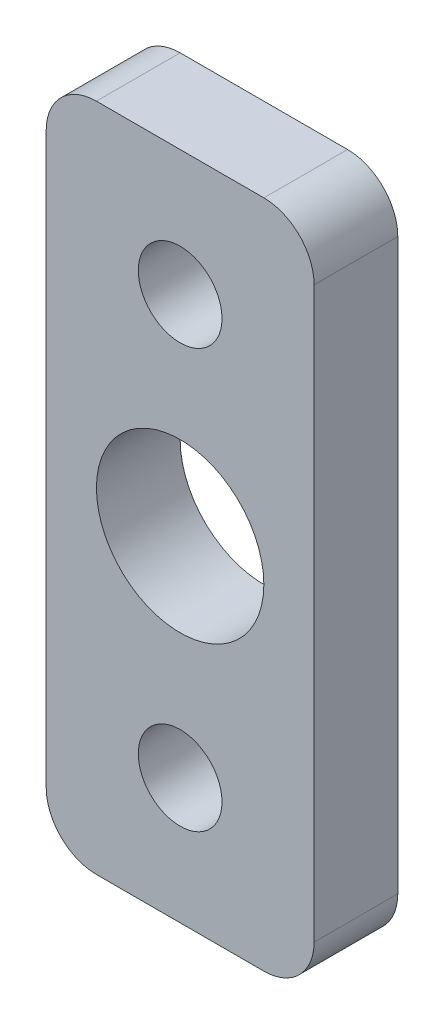
ISO-10303-21;
HEADER;
FILE_DESCRIPTION(('STEP AP214'),'2;1');
FILE_NAME('part.step','',(''),(''),'','','');
FILE_SCHEMA(('AUTOMOTIVE_DESIGN { 1 0 10303 214 1 1 1 1 }'));
ENDSEC;
DATA;
#1=APPLICATION_CONTEXT('core data for automotive mechanical design processes');
#2=APPLICATION_PROTOCOL_DEFINITION('international standard','automotive_design',2000,#1);
#3=PRODUCT_CONTEXT('',#1,'mechanical');
#4=PRODUCT('Part','Part','',(#3));
#5=PRODUCT_RELATED_PRODUCT_CATEGORY('part','',(#4));
#6=PRODUCT_DEFINITION_FORMATION('','',#4);
#7=PRODUCT_DEFINITION_CONTEXT('part definition',#1,'design');
#8=PRODUCT_DEFINITION('design','',#6,#7);
#9=PRODUCT_DEFINITION_SHAPE('','',#8);
#10=(LENGTH_UNIT() NAMED_UNIT(*) SI_UNIT(.MILLI.,.METRE.));
#11=(NAMED_UNIT(*) PLANE_ANGLE_UNIT() SI_UNIT($,.RADIAN.));
#12=(NAMED_UNIT(*) SI_UNIT($,.STERADIAN.) SOLID_ANGLE_UNIT());
#13=UNCERTAINTY_MEASURE_WITH_UNIT(LENGTH_MEASURE(1.E-05),#10,'distance_accuracy_value','');
#14=(GEOMETRIC_REPRESENTATION_CONTEXT(3) GLOBAL_UNCERTAINTY_ASSIGNED_CONTEXT((#13)) GLOBAL_UNIT_ASSIGNED_CONTEXT((#10,
#11,#12)) REPRESENTATION_CONTEXT('',''));
#15=CARTESIAN_POINT('',(0.,0.,0.));
#16=DIRECTION('',(0.,0.,1.));
#17=DIRECTION('',(1.,0.,0.));
#18=AXIS2_PLACEMENT_3D('',#15,#16,#17);
#19=CARTESIAN_POINT('',(0.,0.,5.));
#20=DIRECTION('',(0.,0.,1.));
#21=DIRECTION('',(1.,0.,0.));
#22=AXIS2_PLACEMENT_3D('',#19,#20,#21);
#23=PLANE('',#22);
#24=CARTESIAN_POINT('',(0.,0.,5.));
#25=DIRECTION('',(0.,0.,1.));
#26=DIRECTION('',(1.,0.,0.));
#27=AXIS2_PLACEMENT_3D('',#24,#25,#26);
#28=CIRCLE('',#27,2.5);
#29=CARTESIAN_POINT('',(2.5,0.,5.));
#30=VERTEX_POINT('',#29);
#31=EDGE_CURVE('E183',#30,#30,#28,.T.);
#32=ORIENTED_EDGE('',*,*,#31,.F.);
#33=EDGE_LOOP('',(#32));
#34=FACE_BOUND('',#33,.T.);
#35=DIRECTION('',(0.,1.,0.));
#36=VECTOR('',#35,1.);
#37=CARTESIAN_POINT('',(8.,32.5,5.));
#38=LINE('',#37,#36);
#39=CARTESIAN_POINT('',(8.,-4.49999999999999,5.));
#40=VERTEX_POINT('',#39);
#41=CARTESIAN_POINT('',(8.,29.5,5.));
#42=VERTEX_POINT('',#41);
#43=EDGE_CURVE('E140',#40,#42,#38,.T.);
#44=ORIENTED_EDGE('',*,*,#43,.T.);
#45=CARTESIAN_POINT('',(5.,29.5,5.));
#46=DIRECTION('',(0.,0.,1.));
#47=DIRECTION('',(1.,0.,0.));
#48=AXIS2_PLACEMENT_3D('',#45,#46,#47);
#49=CIRCLE('',#48,3.);
#50=CARTESIAN_POINT('',(5.,32.5,5.));
#51=VERTEX_POINT('',#50);
#52=EDGE_CURVE('E155',#42,#51,#49,.T.);
#53=ORIENTED_EDGE('',*,*,#52,.T.);
#54=DIRECTION('',(-1.,0.,0.));
#55=VECTOR('',#54,1.);
#56=CARTESIAN_POINT('',(-8.,32.5,5.));
#57=LINE('',#56,#55);
#58=CARTESIAN_POINT('',(-5.,32.5,5.));
#59=VERTEX_POINT('',#58);
#60=EDGE_CURVE('E122',#51,#59,#57,.T.);
#61=ORIENTED_EDGE('',*,*,#60,.T.);
#62=CARTESIAN_POINT('',(-5.,29.5,5.));
#63=DIRECTION('',(0.,0.,1.));
#64=DIRECTION('',(1.,0.,0.));
#65=AXIS2_PLACEMENT_3D('',#62,#63,#64);
#66=CIRCLE('',#65,3.);
#67=CARTESIAN_POINT('',(-8.,29.5,5.));
#68=VERTEX_POINT('',#67);
#69=EDGE_CURVE('E153',#59,#68,#66,.T.);
#70=ORIENTED_EDGE('',*,*,#69,.T.);
#71=DIRECTION('',(0.,-1.,0.));
#72=VECTOR('',#71,1.);
#73=CARTESIAN_POINT('',(-8.,32.5,5.));
#74=LINE('',#73,#72);
#75=CARTESIAN_POINT('',(-8.,-4.49999999999999,5.));
#76=VERTEX_POINT('',#75);
#77=EDGE_CURVE('E166',#68,#76,#74,.T.);
#78=ORIENTED_EDGE('',*,*,#77,.T.);
#79=CARTESIAN_POINT('',(-5.,-4.49999999999999,5.));
#80=DIRECTION('',(0.,0.,1.));
#81=DIRECTION('',(1.,0.,0.));
#82=AXIS2_PLACEMENT_3D('',#79,#80,#81);
#83=CIRCLE('',#82,3.);
#84=CARTESIAN_POINT('',(-5.,-7.49999999999999,5.));
#85=VERTEX_POINT('',#84);
#86=EDGE_CURVE('E57',#76,#85,#83,.T.);
#87=ORIENTED_EDGE('',*,*,#86,.T.);
#88=DIRECTION('',(1.,0.,0.));
#89=VECTOR('',#88,1.);
#90=CARTESIAN_POINT('',(-8.,-7.49999999999999,5.));
#91=LINE('',#90,#89);
#92=CARTESIAN_POINT('',(5.,-7.49999999999999,5.));
#93=VERTEX_POINT('',#92);
#94=EDGE_CURVE('E141',#85,#93,#91,.T.);
#95=ORIENTED_EDGE('',*,*,#94,.T.);
#96=CARTESIAN_POINT('',(5.,-4.49999999999999,5.));
#97=DIRECTION('',(0.,0.,1.));
#98=DIRECTION('',(1.,0.,0.));
#99=AXIS2_PLACEMENT_3D('',#96,#97,#98);
#100=CIRCLE('',#99,3.);
#101=EDGE_CURVE('E150',#93,#40,#100,.T.);
#102=ORIENTED_EDGE('',*,*,#101,.T.);
#103=EDGE_LOOP('',(#44,#53,#61,#70,#78,#87,#95,#102));
#104=FACE_BOUND('',#103,.T.);
#105=CARTESIAN_POINT('',(0.,25.,5.));
#106=DIRECTION('',(0.,0.,1.));
#107=DIRECTION('',(1.,0.,0.));
#108=AXIS2_PLACEMENT_3D('',#105,#106,#107);
#109=CIRCLE('',#108,2.5);
#110=CARTESIAN_POINT('',(2.5,25.,5.));
#111=VERTEX_POINT('',#110);
#112=EDGE_CURVE('E135',#111,#111,#109,.T.);
#113=ORIENTED_EDGE('',*,*,#112,.F.);
#114=EDGE_LOOP('',(#113));
#115=FACE_BOUND('',#114,.T.);
#116=CARTESIAN_POINT('',(0.,12.5,5.));
#117=DIRECTION('',(0.,0.,1.));
#118=DIRECTION('',(1.,0.,0.));
#119=AXIS2_PLACEMENT_3D('',#116,#117,#118);
#120=CIRCLE('',#119,5.);
#121=CARTESIAN_POINT('',(5.,12.5,5.));
#122=VERTEX_POINT('',#121);
#123=EDGE_CURVE('E189',#122,#122,#120,.T.);
#124=ORIENTED_EDGE('',*,*,#123,.F.);
#125=EDGE_LOOP('',(#124));
#126=FACE_BOUND('',#125,.T.);
#127=ADVANCED_FACE('F36',(#34,#104,#115,#126),#23,.T.);
#128=CARTESIAN_POINT('',(0.,0.,0.));
#129=DIRECTION('',(0.,0.,1.));
#130=DIRECTION('',(1.,0.,0.));
#131=AXIS2_PLACEMENT_3D('',#128,#129,#130);
#132=PLANE('',#131);
#133=DIRECTION('',(-1.,0.,0.));
#134=VECTOR('',#133,1.);
#135=CARTESIAN_POINT('',(-8.,32.5,0.));
#136=LINE('',#135,#134);
#137=CARTESIAN_POINT('',(5.,32.5,0.));
#138=VERTEX_POINT('',#137);
#139=CARTESIAN_POINT('',(-5.,32.5,0.));
#140=VERTEX_POINT('',#139);
#141=EDGE_CURVE('E119',#138,#140,#136,.T.);
#142=ORIENTED_EDGE('',*,*,#141,.F.);
#143=CARTESIAN_POINT('',(5.,29.5,0.));
#144=DIRECTION('',(0.,0.,1.));
#145=DIRECTION('',(1.,0.,0.));
#146=AXIS2_PLACEMENT_3D('',#143,#144,#145);
#147=CIRCLE('',#146,3.);
#148=CARTESIAN_POINT('',(8.,29.5,0.));
#149=VERTEX_POINT('',#148);
#150=EDGE_CURVE('E102',#138,#149,#147,.F.);
#151=ORIENTED_EDGE('',*,*,#150,.T.);
#152=DIRECTION('',(0.,1.,0.));
#153=VECTOR('',#152,1.);
#154=CARTESIAN_POINT('',(8.,32.5,0.));
#155=LINE('',#154,#153);
#156=CARTESIAN_POINT('',(8.,-4.49999999999999,0.));
#157=VERTEX_POINT('',#156);
#158=EDGE_CURVE('E130',#157,#149,#155,.T.);
#159=ORIENTED_EDGE('',*,*,#158,.F.);
#160=CARTESIAN_POINT('',(5.,-4.49999999999999,0.));
#161=DIRECTION('',(0.,0.,1.));
#162=DIRECTION('',(1.,0.,0.));
#163=AXIS2_PLACEMENT_3D('',#160,#161,#162);
#164=CIRCLE('',#163,3.);
#165=CARTESIAN_POINT('',(5.,-7.49999999999999,0.));
#166=VERTEX_POINT('',#165);
#167=EDGE_CURVE('E123',#157,#166,#164,.F.);
#168=ORIENTED_EDGE('',*,*,#167,.T.);
#169=DIRECTION('',(1.,0.,0.));
#170=VECTOR('',#169,1.);
#171=CARTESIAN_POINT('',(-8.,-7.49999999999999,0.));
#172=LINE('',#171,#170);
#173=CARTESIAN_POINT('',(-5.,-7.49999999999999,0.));
#174=VERTEX_POINT('',#173);
#175=EDGE_CURVE('E133',#174,#166,#172,.T.);
#176=ORIENTED_EDGE('',*,*,#175,.F.);
#177=CARTESIAN_POINT('',(-5.,-4.49999999999999,0.));
#178=DIRECTION('',(0.,0.,1.));
#179=DIRECTION('',(1.,0.,0.));
#180=AXIS2_PLACEMENT_3D('',#177,#178,#179);
#181=CIRCLE('',#180,3.);
#182=CARTESIAN_POINT('',(-8.,-4.49999999999999,0.));
#183=VERTEX_POINT('',#182);
#184=EDGE_CURVE('E144',#174,#183,#181,.F.);
#185=ORIENTED_EDGE('',*,*,#184,.T.);
#186=DIRECTION('',(0.,-1.,0.));
#187=VECTOR('',#186,1.);
#188=CARTESIAN_POINT('',(-8.,32.5,0.));
#189=LINE('',#188,#187);
#190=CARTESIAN_POINT('',(-8.,29.5,0.));
#191=VERTEX_POINT('',#190);
#192=EDGE_CURVE('E129',#191,#183,#189,.T.);
#193=ORIENTED_EDGE('',*,*,#192,.F.);
#194=CARTESIAN_POINT('',(-5.,29.5,0.));
#195=DIRECTION('',(0.,0.,1.));
#196=DIRECTION('',(1.,0.,0.));
#197=AXIS2_PLACEMENT_3D('',#194,#195,#196);
#198=CIRCLE('',#197,3.);
#199=EDGE_CURVE('E113',#191,#140,#198,.F.);
#200=ORIENTED_EDGE('',*,*,#199,.T.);
#201=EDGE_LOOP('',(#142,#151,#159,#168,#176,#185,#193,#200));
#202=FACE_BOUND('',#201,.T.);
#203=CARTESIAN_POINT('',(0.,25.,0.));
#204=DIRECTION('',(0.,0.,1.));
#205=DIRECTION('',(1.,0.,0.));
#206=AXIS2_PLACEMENT_3D('',#203,#204,#205);
#207=CIRCLE('',#206,2.5);
#208=CARTESIAN_POINT('',(2.5,25.,0.));
#209=VERTEX_POINT('',#208);
#210=EDGE_CURVE('E180',#209,#209,#207,.T.);
#211=ORIENTED_EDGE('',*,*,#210,.T.);
#212=EDGE_LOOP('',(#211));
#213=FACE_BOUND('',#212,.T.);
#214=CARTESIAN_POINT('',(0.,0.,0.));
#215=DIRECTION('',(0.,0.,1.));
#216=DIRECTION('',(1.,0.,0.));
#217=AXIS2_PLACEMENT_3D('',#214,#215,#216);
#218=CIRCLE('',#217,2.5);
#219=CARTESIAN_POINT('',(2.5,0.,0.));
#220=VERTEX_POINT('',#219);
#221=EDGE_CURVE('E186',#220,#220,#218,.T.);
#222=ORIENTED_EDGE('',*,*,#221,.T.);
#223=EDGE_LOOP('',(#222));
#224=FACE_BOUND('',#223,.T.);
#225=CARTESIAN_POINT('',(0.,12.5,0.));
#226=DIRECTION('',(0.,0.,1.));
#227=DIRECTION('',(1.,0.,0.));
#228=AXIS2_PLACEMENT_3D('',#225,#226,#227);
#229=CIRCLE('',#228,5.);
#230=CARTESIAN_POINT('',(5.,12.5,0.));
#231=VERTEX_POINT('',#230);
#232=EDGE_CURVE('E192',#231,#231,#229,.T.);
#233=ORIENTED_EDGE('',*,*,#232,.T.);
#234=EDGE_LOOP('',(#233));
#235=FACE_BOUND('',#234,.T.);
#236=ADVANCED_FACE('F126',(#202,#213,#224,#235),#132,.F.);
#237=CARTESIAN_POINT('',(8.,32.5,5.));
#238=DIRECTION('',(-1.,0.,0.));
#239=DIRECTION('',(0.,-1.,0.));
#240=AXIS2_PLACEMENT_3D('',#237,#238,#239);
#241=PLANE('',#240);
#242=ORIENTED_EDGE('',*,*,#158,.T.);
#243=DIRECTION('',(0.,0.,-1.));
#244=VECTOR('',#243,1.);
#245=CARTESIAN_POINT('',(8.,29.5,5.));
#246=LINE('',#245,#244);
#247=EDGE_CURVE('E107',#149,#42,#246,.F.);
#248=ORIENTED_EDGE('',*,*,#247,.T.);
#249=ORIENTED_EDGE('',*,*,#43,.F.);
#250=DIRECTION('',(0.,0.,-1.));
#251=VECTOR('',#250,1.);
#252=CARTESIAN_POINT('',(8.,-4.49999999999999,5.));
#253=LINE('',#252,#251);
#254=EDGE_CURVE('E112',#40,#157,#253,.T.);
#255=ORIENTED_EDGE('',*,*,#254,.T.);
#256=EDGE_LOOP('',(#242,#248,#249,#255));
#257=FACE_BOUND('',#256,.T.);
#258=ADVANCED_FACE('F207',(#257),#241,.F.);
#259=CARTESIAN_POINT('',(-8.,32.5,5.));
#260=DIRECTION('',(0.,-1.,0.));
#261=DIRECTION('',(0.,0.,-1.));
#262=AXIS2_PLACEMENT_3D('',#259,#260,#261);
#263=PLANE('',#262);
#264=ORIENTED_EDGE('',*,*,#60,.F.);
#265=DIRECTION('',(0.,0.,-1.));
#266=VECTOR('',#265,1.);
#267=CARTESIAN_POINT('',(5.,32.5,5.));
#268=LINE('',#267,#266);
#269=EDGE_CURVE('E106',#51,#138,#268,.T.);
#270=ORIENTED_EDGE('',*,*,#269,.T.);
#271=ORIENTED_EDGE('',*,*,#141,.T.);
#272=DIRECTION('',(0.,0.,-1.));
#273=VECTOR('',#272,1.);
#274=CARTESIAN_POINT('',(-5.,32.5,5.));
#275=LINE('',#274,#273);
#276=EDGE_CURVE('E124',#140,#59,#275,.F.);
#277=ORIENTED_EDGE('',*,*,#276,.T.);
#278=EDGE_LOOP('',(#264,#270,#271,#277));
#279=FACE_BOUND('',#278,.T.);
#280=ADVANCED_FACE('F118',(#279),#263,.F.);
#281=CARTESIAN_POINT('',(-8.,32.5,5.));
#282=DIRECTION('',(1.,0.,0.));
#283=DIRECTION('',(0.,1.,0.));
#284=AXIS2_PLACEMENT_3D('',#281,#282,#283);
#285=PLANE('',#284);
#286=ORIENTED_EDGE('',*,*,#77,.F.);
#287=DIRECTION('',(0.,0.,-1.));
#288=VECTOR('',#287,1.);
#289=CARTESIAN_POINT('',(-8.,29.5,5.));
#290=LINE('',#289,#288);
#291=EDGE_CURVE('E159',#68,#191,#290,.T.);
#292=ORIENTED_EDGE('',*,*,#291,.T.);
#293=ORIENTED_EDGE('',*,*,#192,.T.);
#294=DIRECTION('',(0.,0.,-1.));
#295=VECTOR('',#294,1.);
#296=CARTESIAN_POINT('',(-8.,-4.49999999999999,5.));
#297=LINE('',#296,#295);
#298=EDGE_CURVE('E157',#183,#76,#297,.F.);
#299=ORIENTED_EDGE('',*,*,#298,.T.);
#300=EDGE_LOOP('',(#286,#292,#293,#299));
#301=FACE_BOUND('',#300,.T.);
#302=ADVANCED_FACE('F164',(#301),#285,.F.);
#303=CARTESIAN_POINT('',(-8.,-7.49999999999999,5.));
#304=DIRECTION('',(0.,1.,0.));
#305=DIRECTION('',(0.,0.,1.));
#306=AXIS2_PLACEMENT_3D('',#303,#304,#305);
#307=PLANE('',#306);
#308=ORIENTED_EDGE('',*,*,#94,.F.);
#309=DIRECTION('',(0.,0.,-1.));
#310=VECTOR('',#309,1.);
#311=CARTESIAN_POINT('',(-5.,-7.49999999999999,5.));
#312=LINE('',#311,#310);
#313=EDGE_CURVE('E11',#85,#174,#312,.T.);
#314=ORIENTED_EDGE('',*,*,#313,.T.);
#315=ORIENTED_EDGE('',*,*,#175,.T.);
#316=DIRECTION('',(0.,0.,-1.));
#317=VECTOR('',#316,1.);
#318=CARTESIAN_POINT('',(5.,-7.49999999999999,5.));
#319=LINE('',#318,#317);
#320=EDGE_CURVE('E44',#166,#93,#319,.F.);
#321=ORIENTED_EDGE('',*,*,#320,.T.);
#322=EDGE_LOOP('',(#308,#314,#315,#321));
#323=FACE_BOUND('',#322,.T.);
#324=ADVANCED_FACE('F173',(#323),#307,.F.);
#325=CARTESIAN_POINT('',(0.,25.,5.));
#326=DIRECTION('',(0.,0.,-1.));
#327=DIRECTION('',(-1.,0.,0.));
#328=AXIS2_PLACEMENT_3D('',#325,#326,#327);
#329=CYLINDRICAL_SURFACE('',#328,2.5);
#330=ORIENTED_EDGE('',*,*,#112,.T.);
#331=EDGE_LOOP('',(#330));
#332=FACE_BOUND('',#331,.T.);
#333=ORIENTED_EDGE('',*,*,#210,.F.);
#334=EDGE_LOOP('',(#333));
#335=FACE_BOUND('',#334,.T.);
#336=ADVANCED_FACE('F211',(#332,#335),#329,.F.);
#337=CARTESIAN_POINT('',(0.,0.,5.));
#338=DIRECTION('',(0.,0.,-1.));
#339=DIRECTION('',(-1.,0.,0.));
#340=AXIS2_PLACEMENT_3D('',#337,#338,#339);
#341=CYLINDRICAL_SURFACE('',#340,2.5);
#342=ORIENTED_EDGE('',*,*,#31,.T.);
#343=EDGE_LOOP('',(#342));
#344=FACE_BOUND('',#343,.T.);
#345=ORIENTED_EDGE('',*,*,#221,.F.);
#346=EDGE_LOOP('',(#345));
#347=FACE_BOUND('',#346,.T.);
#348=ADVANCED_FACE('F241',(#344,#347),#341,.F.);
#349=CARTESIAN_POINT('',(0.,12.5,5.));
#350=DIRECTION('',(0.,0.,-1.));
#351=DIRECTION('',(-1.,0.,0.));
#352=AXIS2_PLACEMENT_3D('',#349,#350,#351);
#353=CYLINDRICAL_SURFACE('',#352,5.);
#354=ORIENTED_EDGE('',*,*,#123,.T.);
#355=EDGE_LOOP('',(#354));
#356=FACE_BOUND('',#355,.T.);
#357=ORIENTED_EDGE('',*,*,#232,.F.);
#358=EDGE_LOOP('',(#357));
#359=FACE_BOUND('',#358,.T.);
#360=ADVANCED_FACE('F198',(#356,#359),#353,.F.);
#361=CARTESIAN_POINT('',(5.,29.5,5.));
#362=DIRECTION('',(0.,0.,-1.));
#363=DIRECTION('',(-1.,0.,0.));
#364=AXIS2_PLACEMENT_3D('',#361,#362,#363);
#365=CYLINDRICAL_SURFACE('',#364,3.);
#366=ORIENTED_EDGE('',*,*,#52,.F.);
#367=ORIENTED_EDGE('',*,*,#247,.F.);
#368=ORIENTED_EDGE('',*,*,#150,.F.);
#369=ORIENTED_EDGE('',*,*,#269,.F.);
#370=EDGE_LOOP('',(#366,#367,#368,#369));
#371=FACE_BOUND('',#370,.T.);
#372=ADVANCED_FACE('F105',(#371),#365,.T.);
#373=CARTESIAN_POINT('',(-5.,29.5,5.));
#374=DIRECTION('',(0.,0.,-1.));
#375=DIRECTION('',(-1.,0.,0.));
#376=AXIS2_PLACEMENT_3D('',#373,#374,#375);
#377=CYLINDRICAL_SURFACE('',#376,3.);
#378=ORIENTED_EDGE('',*,*,#69,.F.);
#379=ORIENTED_EDGE('',*,*,#276,.F.);
#380=ORIENTED_EDGE('',*,*,#199,.F.);
#381=ORIENTED_EDGE('',*,*,#291,.F.);
#382=EDGE_LOOP('',(#378,#379,#380,#381));
#383=FACE_BOUND('',#382,.T.);
#384=ADVANCED_FACE('F225',(#383),#377,.T.);
#385=CARTESIAN_POINT('',(-5.,-4.49999999999999,5.));
#386=DIRECTION('',(0.,0.,-1.));
#387=DIRECTION('',(-1.,0.,0.));
#388=AXIS2_PLACEMENT_3D('',#385,#386,#387);
#389=CYLINDRICAL_SURFACE('',#388,3.);
#390=ORIENTED_EDGE('',*,*,#86,.F.);
#391=ORIENTED_EDGE('',*,*,#298,.F.);
#392=ORIENTED_EDGE('',*,*,#184,.F.);
#393=ORIENTED_EDGE('',*,*,#313,.F.);
#394=EDGE_LOOP('',(#390,#391,#392,#393));
#395=FACE_BOUND('',#394,.T.);
#396=ADVANCED_FACE('F172',(#395),#389,.T.);
#397=CARTESIAN_POINT('',(5.,-4.49999999999999,5.));
#398=DIRECTION('',(0.,0.,-1.));
#399=DIRECTION('',(-1.,0.,0.));
#400=AXIS2_PLACEMENT_3D('',#397,#398,#399);
#401=CYLINDRICAL_SURFACE('',#400,3.);
#402=ORIENTED_EDGE('',*,*,#101,.F.);
#403=ORIENTED_EDGE('',*,*,#320,.F.);
#404=ORIENTED_EDGE('',*,*,#167,.F.);
#405=ORIENTED_EDGE('',*,*,#254,.F.);
#406=EDGE_LOOP('',(#402,#403,#404,#405));
#407=FACE_BOUND('',#406,.T.);
#408=ADVANCED_FACE('F38',(#407),#401,.T.);
#409=CLOSED_SHELL('',(#127,#236,#258,#280,#302,#324,#336,#348,#360,#372,#384,#396,#408));
#410=MANIFOLD_SOLID_BREP('B2',#409);
#411=ADVANCED_BREP_SHAPE_REPRESENTATION('',(#18,#410),#14);
#412=SHAPE_DEFINITION_REPRESENTATION(#9,#411);
ENDSEC;
END-ISO-10303-21;
